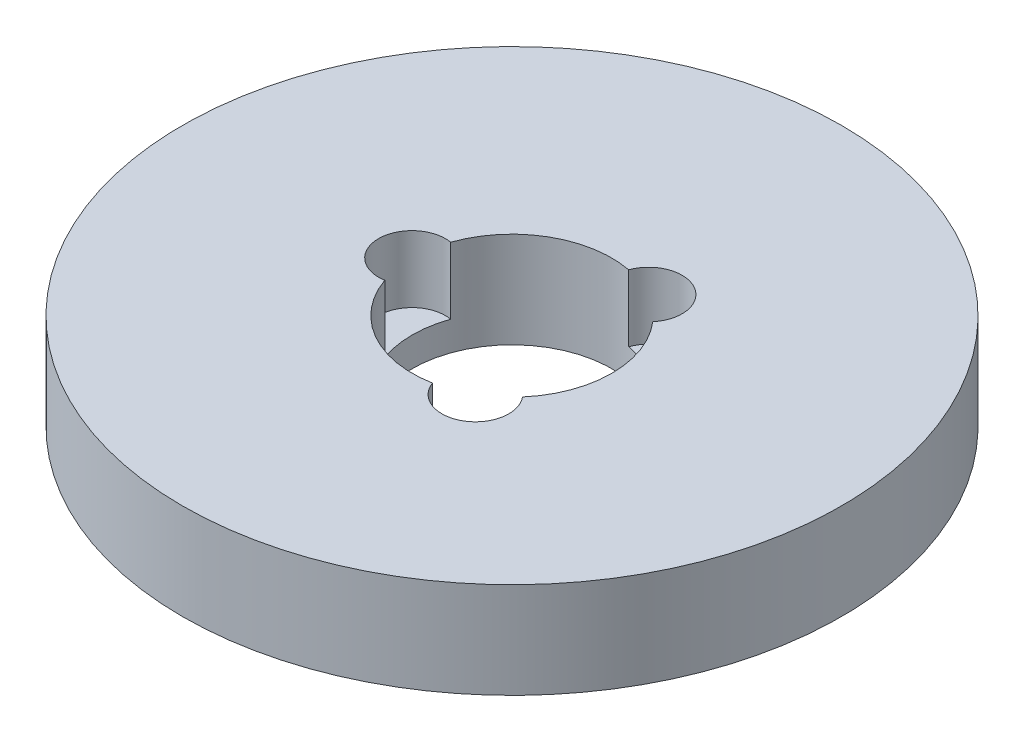
ISO-10303-21;
HEADER;
FILE_DESCRIPTION(('STEP AP214'),'2;1');
FILE_NAME('part.step','',(''),(''),'','','');
FILE_SCHEMA(('AUTOMOTIVE_DESIGN { 1 0 10303 214 1 1 1 1 }'));
ENDSEC;
DATA;
#1=APPLICATION_CONTEXT('core data for automotive mechanical design processes');
#2=APPLICATION_PROTOCOL_DEFINITION('international standard','automotive_design',2000,#1);
#3=PRODUCT_CONTEXT('',#1,'mechanical');
#4=PRODUCT('Part','Part','',(#3));
#5=PRODUCT_RELATED_PRODUCT_CATEGORY('part','',(#4));
#6=PRODUCT_DEFINITION_FORMATION('','',#4);
#7=PRODUCT_DEFINITION_CONTEXT('part definition',#1,'design');
#8=PRODUCT_DEFINITION('design','',#6,#7);
#9=PRODUCT_DEFINITION_SHAPE('','',#8);
#10=(LENGTH_UNIT() NAMED_UNIT(*) SI_UNIT(.MILLI.,.METRE.));
#11=(NAMED_UNIT(*) PLANE_ANGLE_UNIT() SI_UNIT($,.RADIAN.));
#12=(NAMED_UNIT(*) SI_UNIT($,.STERADIAN.) SOLID_ANGLE_UNIT());
#13=UNCERTAINTY_MEASURE_WITH_UNIT(LENGTH_MEASURE(1.E-05),#10,'distance_accuracy_value','');
#14=(GEOMETRIC_REPRESENTATION_CONTEXT(3) GLOBAL_UNCERTAINTY_ASSIGNED_CONTEXT((#13)) GLOBAL_UNIT_ASSIGNED_CONTEXT((#10,
#11,#12)) REPRESENTATION_CONTEXT('',''));
#15=CARTESIAN_POINT('',(0.,0.,0.));
#16=DIRECTION('',(0.,0.,1.));
#17=DIRECTION('',(1.,0.,0.));
#18=AXIS2_PLACEMENT_3D('',#15,#16,#17);
#19=CARTESIAN_POINT('',(0.,24.,0.));
#20=DIRECTION('',(0.,-1.,0.));
#21=DIRECTION('',(0.,0.,-1.));
#22=AXIS2_PLACEMENT_3D('',#19,#20,#21);
#23=CYLINDRICAL_SURFACE('',#22,82.5);
#24=CARTESIAN_POINT('',(0.,24.,0.));
#25=DIRECTION('',(0.,1.,0.));
#26=DIRECTION('',(0.,0.,1.));
#27=AXIS2_PLACEMENT_3D('',#24,#25,#26);
#28=CIRCLE('',#27,82.5);
#29=CARTESIAN_POINT('',(0.,24.,82.5));
#30=VERTEX_POINT('',#29);
#31=EDGE_CURVE('E126',#30,#30,#28,.T.);
#32=ORIENTED_EDGE('',*,*,#31,.F.);
#33=EDGE_LOOP('',(#32));
#34=FACE_BOUND('',#33,.T.);
#35=CARTESIAN_POINT('',(0.,0.,0.));
#36=DIRECTION('',(0.,1.,0.));
#37=DIRECTION('',(0.,0.,1.));
#38=AXIS2_PLACEMENT_3D('',#35,#36,#37);
#39=CIRCLE('',#38,82.5);
#40=CARTESIAN_POINT('',(0.,0.,82.5));
#41=VERTEX_POINT('',#40);
#42=EDGE_CURVE('E124',#41,#41,#39,.T.);
#43=ORIENTED_EDGE('',*,*,#42,.T.);
#44=EDGE_LOOP('',(#43));
#45=FACE_BOUND('',#44,.T.);
#46=ADVANCED_FACE('F39',(#34,#45),#23,.T.);
#47=CARTESIAN_POINT('',(0.,24.,0.));
#48=DIRECTION('',(0.,1.,0.));
#49=DIRECTION('',(0.,0.,1.));
#50=AXIS2_PLACEMENT_3D('',#47,#48,#49);
#51=PLANE('',#50);
#52=CARTESIAN_POINT('',(12.5195269159446,24.,21.684456705142));
#53=DIRECTION('',(0.,1.,0.));
#54=DIRECTION('',(0.866025403784436,0.,-0.500000000000004));
#55=AXIS2_PLACEMENT_3D('',#52,#53,#54);
#56=CIRCLE('',#55,8.37374764726861);
#57=CARTESIAN_POINT('',(4.65594976747831,24.,24.5626165496007));
#58=VERTEX_POINT('',#57);
#59=CARTESIAN_POINT('',(18.9438750316313,24.,16.3134790521806));
#60=VERTEX_POINT('',#59);
#61=EDGE_CURVE('E147',#58,#60,#56,.T.);
#62=ORIENTED_EDGE('',*,*,#61,.F.);
#63=CARTESIAN_POINT('',(0.,24.,0.));
#64=DIRECTION('',(0.,1.,0.));
#65=DIRECTION('',(0.,0.,1.));
#66=AXIS2_PLACEMENT_3D('',#63,#64,#65);
#67=CIRCLE('',#66,25.);
#68=CARTESIAN_POINT('',(-23.5998247991094,24.,8.24913749742));
#69=VERTEX_POINT('',#68);
#70=EDGE_CURVE('E118',#69,#58,#67,.T.);
#71=ORIENTED_EDGE('',*,*,#70,.F.);
#72=CARTESIAN_POINT('',(-25.039053831889,24.,0.));
#73=DIRECTION('',(0.,1.,0.));
#74=DIRECTION('',(0.,0.,1.));
#75=AXIS2_PLACEMENT_3D('',#72,#73,#74);
#76=CIRCLE('',#75,8.37374764726861);
#77=CARTESIAN_POINT('',(-23.5998247991094,24.,-8.24913749742));
#78=VERTEX_POINT('',#77);
#79=EDGE_CURVE('E113',#78,#69,#76,.T.);
#80=ORIENTED_EDGE('',*,*,#79,.F.);
#81=CARTESIAN_POINT('',(4.65594976747797,24.,-24.5626165496008));
#82=VERTEX_POINT('',#81);
#83=EDGE_CURVE('E106',#82,#78,#67,.T.);
#84=ORIENTED_EDGE('',*,*,#83,.F.);
#85=CARTESIAN_POINT('',(12.5195269159443,24.,-21.6844567051421));
#86=DIRECTION('',(0.,1.,0.));
#87=DIRECTION('',(-0.866025403784443,0.,-0.499999999999992));
#88=AXIS2_PLACEMENT_3D('',#85,#86,#87);
#89=CIRCLE('',#88,8.37374764726861);
#90=CARTESIAN_POINT('',(18.9438750316311,24.,-16.3134790521809));
#91=VERTEX_POINT('',#90);
#92=EDGE_CURVE('E90',#91,#82,#89,.T.);
#93=ORIENTED_EDGE('',*,*,#92,.F.);
#94=EDGE_CURVE('E116',#60,#91,#67,.T.);
#95=ORIENTED_EDGE('',*,*,#94,.F.);
#96=EDGE_LOOP('',(#62,#71,#80,#84,#93,#95));
#97=FACE_BOUND('',#96,.T.);
#98=ORIENTED_EDGE('',*,*,#31,.T.);
#99=EDGE_LOOP('',(#98));
#100=FACE_BOUND('',#99,.T.);
#101=ADVANCED_FACE('F115',(#97,#100),#51,.T.);
#102=CARTESIAN_POINT('',(0.,0.,0.));
#103=DIRECTION('',(0.,1.,0.));
#104=DIRECTION('',(0.,0.,1.));
#105=AXIS2_PLACEMENT_3D('',#102,#103,#104);
#106=PLANE('',#105);
#107=CARTESIAN_POINT('',(0.,0.,0.));
#108=DIRECTION('',(0.,1.,0.));
#109=DIRECTION('',(0.,0.,1.));
#110=AXIS2_PLACEMENT_3D('',#107,#108,#109);
#111=CIRCLE('',#110,25.);
#112=CARTESIAN_POINT('',(0.,0.,25.));
#113=VERTEX_POINT('',#112);
#114=EDGE_CURVE('E120',#113,#113,#111,.T.);
#115=ORIENTED_EDGE('',*,*,#114,.T.);
#116=EDGE_LOOP('',(#115));
#117=FACE_BOUND('',#116,.T.);
#118=ORIENTED_EDGE('',*,*,#42,.F.);
#119=EDGE_LOOP('',(#118));
#120=FACE_BOUND('',#119,.T.);
#121=ADVANCED_FACE('F164',(#117,#120),#106,.F.);
#122=CARTESIAN_POINT('',(0.,24.,0.));
#123=DIRECTION('',(0.,-1.,0.));
#124=DIRECTION('',(0.,0.,-1.));
#125=AXIS2_PLACEMENT_3D('',#122,#123,#124);
#126=CYLINDRICAL_SURFACE('',#125,25.);
#127=DIRECTION('',(0.,1.,0.));
#128=VECTOR('',#127,1.);
#129=CARTESIAN_POINT('',(4.65594976747831,15.6559864206288,24.5626165496007));
#130=LINE('',#129,#128);
#131=CARTESIAN_POINT('',(4.65594976747831,7.3119728412577,24.5626165496007));
#132=VERTEX_POINT('',#131);
#133=EDGE_CURVE('E11',#132,#58,#130,.T.);
#134=ORIENTED_EDGE('',*,*,#133,.F.);
#135=CARTESIAN_POINT('',(0.,7.3119728412577,0.));
#136=DIRECTION('',(0.,1.,0.));
#137=DIRECTION('',(0.,0.,1.));
#138=AXIS2_PLACEMENT_3D('',#135,#136,#137);
#139=CIRCLE('',#138,25.);
#140=CARTESIAN_POINT('',(18.9438750316313,7.3119728412577,16.3134790521806));
#141=VERTEX_POINT('',#140);
#142=EDGE_CURVE('E144',#132,#141,#139,.T.);
#143=ORIENTED_EDGE('',*,*,#142,.T.);
#144=DIRECTION('',(0.,1.,0.));
#145=VECTOR('',#144,1.);
#146=CARTESIAN_POINT('',(18.9438750316313,15.6559864206288,16.3134790521806));
#147=LINE('',#146,#145);
#148=EDGE_CURVE('E46',#60,#141,#147,.F.);
#149=ORIENTED_EDGE('',*,*,#148,.F.);
#150=ORIENTED_EDGE('',*,*,#94,.T.);
#151=DIRECTION('',(0.,1.,0.));
#152=VECTOR('',#151,1.);
#153=CARTESIAN_POINT('',(18.9438750316311,15.6559864206288,-16.3134790521809));
#154=LINE('',#153,#152);
#155=CARTESIAN_POINT('',(18.9438750316311,7.3119728412577,-16.3134790521809));
#156=VERTEX_POINT('',#155);
#157=EDGE_CURVE('E92',#156,#91,#154,.T.);
#158=ORIENTED_EDGE('',*,*,#157,.F.);
#159=CARTESIAN_POINT('',(0.,7.3119728412577,0.));
#160=DIRECTION('',(0.,1.,0.));
#161=DIRECTION('',(0.,0.,1.));
#162=AXIS2_PLACEMENT_3D('',#159,#160,#161);
#163=CIRCLE('',#162,25.);
#164=CARTESIAN_POINT('',(4.65594976747797,7.3119728412577,-24.5626165496008));
#165=VERTEX_POINT('',#164);
#166=EDGE_CURVE('E107',#156,#165,#163,.T.);
#167=ORIENTED_EDGE('',*,*,#166,.T.);
#168=DIRECTION('',(0.,1.,0.));
#169=VECTOR('',#168,1.);
#170=CARTESIAN_POINT('',(4.65594976747797,15.6559864206288,-24.5626165496008));
#171=LINE('',#170,#169);
#172=EDGE_CURVE('E95',#82,#165,#171,.F.);
#173=ORIENTED_EDGE('',*,*,#172,.F.);
#174=ORIENTED_EDGE('',*,*,#83,.T.);
#175=DIRECTION('',(0.,1.,0.));
#176=VECTOR('',#175,1.);
#177=CARTESIAN_POINT('',(-23.5998247991094,15.6559864206288,-8.24913749742));
#178=LINE('',#177,#176);
#179=CARTESIAN_POINT('',(-23.5998247991094,7.3119728412577,-8.24913749742));
#180=VERTEX_POINT('',#179);
#181=EDGE_CURVE('E143',#180,#78,#178,.T.);
#182=ORIENTED_EDGE('',*,*,#181,.F.);
#183=CARTESIAN_POINT('',(0.,7.3119728412577,0.));
#184=DIRECTION('',(0.,1.,0.));
#185=DIRECTION('',(0.,0.,1.));
#186=AXIS2_PLACEMENT_3D('',#183,#184,#185);
#187=CIRCLE('',#186,25.);
#188=CARTESIAN_POINT('',(-23.5998247991094,7.3119728412577,8.24913749742));
#189=VERTEX_POINT('',#188);
#190=EDGE_CURVE('E132',#180,#189,#187,.T.);
#191=ORIENTED_EDGE('',*,*,#190,.T.);
#192=DIRECTION('',(0.,1.,0.));
#193=VECTOR('',#192,1.);
#194=CARTESIAN_POINT('',(-23.5998247991094,15.6559864206288,8.24913749742));
#195=LINE('',#194,#193);
#196=EDGE_CURVE('E137',#69,#189,#195,.F.);
#197=ORIENTED_EDGE('',*,*,#196,.F.);
#198=ORIENTED_EDGE('',*,*,#70,.T.);
#199=EDGE_LOOP('',(#134,#143,#149,#150,#158,#167,#173,#174,#182,#191,#197,#198));
#200=FACE_BOUND('',#199,.T.);
#201=ORIENTED_EDGE('',*,*,#114,.F.);
#202=EDGE_LOOP('',(#201));
#203=FACE_BOUND('',#202,.T.);
#204=ADVANCED_FACE('F103',(#200,#203),#126,.F.);
#205=CARTESIAN_POINT('',(-25.039053831889,7.3119728412577,0.));
#206=DIRECTION('',(0.,1.,0.));
#207=DIRECTION('',(0.,0.,1.));
#208=AXIS2_PLACEMENT_3D('',#205,#206,#207);
#209=CYLINDRICAL_SURFACE('',#208,8.37374764726861);
#210=ORIENTED_EDGE('',*,*,#181,.T.);
#211=ORIENTED_EDGE('',*,*,#79,.T.);
#212=ORIENTED_EDGE('',*,*,#196,.T.);
#213=CARTESIAN_POINT('',(-25.039053831889,7.3119728412577,0.));
#214=DIRECTION('',(0.,1.,0.));
#215=DIRECTION('',(0.,0.,1.));
#216=AXIS2_PLACEMENT_3D('',#213,#214,#215);
#217=CIRCLE('',#216,8.37374764726861);
#218=EDGE_CURVE('E121',#180,#189,#217,.T.);
#219=ORIENTED_EDGE('',*,*,#218,.F.);
#220=EDGE_LOOP('',(#210,#211,#212,#219));
#221=FACE_BOUND('',#220,.T.);
#222=ADVANCED_FACE('F174',(#221),#209,.F.);
#223=CARTESIAN_POINT('',(-25.039053831889,7.3119728412577,0.));
#224=DIRECTION('',(0.,1.,0.));
#225=DIRECTION('',(0.,0.,1.));
#226=AXIS2_PLACEMENT_3D('',#223,#224,#225);
#227=PLANE('',#226);
#228=ORIENTED_EDGE('',*,*,#218,.T.);
#229=ORIENTED_EDGE('',*,*,#190,.F.);
#230=EDGE_LOOP('',(#228,#229));
#231=FACE_BOUND('',#230,.T.);
#232=ADVANCED_FACE('F177',(#231),#227,.T.);
#233=CARTESIAN_POINT('',(12.5195269159443,7.3119728412577,-21.6844567051421));
#234=DIRECTION('',(0.,1.,0.));
#235=DIRECTION('',(0.,0.,1.));
#236=AXIS2_PLACEMENT_3D('',#233,#234,#235);
#237=CYLINDRICAL_SURFACE('',#236,8.37374764726861);
#238=ORIENTED_EDGE('',*,*,#157,.T.);
#239=ORIENTED_EDGE('',*,*,#92,.T.);
#240=ORIENTED_EDGE('',*,*,#172,.T.);
#241=CARTESIAN_POINT('',(12.5195269159443,7.3119728412577,-21.6844567051421));
#242=DIRECTION('',(0.,1.,0.));
#243=DIRECTION('',(-0.866025403784443,0.,-0.499999999999992));
#244=AXIS2_PLACEMENT_3D('',#241,#242,#243);
#245=CIRCLE('',#244,8.37374764726861);
#246=EDGE_CURVE('E56',#156,#165,#245,.T.);
#247=ORIENTED_EDGE('',*,*,#246,.F.);
#248=EDGE_LOOP('',(#238,#239,#240,#247));
#249=FACE_BOUND('',#248,.T.);
#250=ADVANCED_FACE('F93',(#249),#237,.F.);
#251=CARTESIAN_POINT('',(12.5195269159443,7.3119728412577,-21.6844567051421));
#252=DIRECTION('',(0.,1.,0.));
#253=DIRECTION('',(-0.866025403784443,0.,-0.499999999999992));
#254=AXIS2_PLACEMENT_3D('',#251,#252,#253);
#255=PLANE('',#254);
#256=ORIENTED_EDGE('',*,*,#246,.T.);
#257=ORIENTED_EDGE('',*,*,#166,.F.);
#258=EDGE_LOOP('',(#256,#257));
#259=FACE_BOUND('',#258,.T.);
#260=ADVANCED_FACE('F160',(#259),#255,.T.);
#261=CARTESIAN_POINT('',(12.5195269159446,7.3119728412577,21.684456705142));
#262=DIRECTION('',(0.,1.,0.));
#263=DIRECTION('',(0.,0.,1.));
#264=AXIS2_PLACEMENT_3D('',#261,#262,#263);
#265=CYLINDRICAL_SURFACE('',#264,8.37374764726861);
#266=ORIENTED_EDGE('',*,*,#133,.T.);
#267=ORIENTED_EDGE('',*,*,#61,.T.);
#268=ORIENTED_EDGE('',*,*,#148,.T.);
#269=CARTESIAN_POINT('',(12.5195269159446,7.3119728412577,21.684456705142));
#270=DIRECTION('',(0.,1.,0.));
#271=DIRECTION('',(0.866025403784436,0.,-0.500000000000004));
#272=AXIS2_PLACEMENT_3D('',#269,#270,#271);
#273=CIRCLE('',#272,8.37374764726861);
#274=EDGE_CURVE('E55',#132,#141,#273,.T.);
#275=ORIENTED_EDGE('',*,*,#274,.F.);
#276=EDGE_LOOP('',(#266,#267,#268,#275));
#277=FACE_BOUND('',#276,.T.);
#278=ADVANCED_FACE('F149',(#277),#265,.F.);
#279=CARTESIAN_POINT('',(12.5195269159446,7.3119728412577,21.684456705142));
#280=DIRECTION('',(0.,1.,0.));
#281=DIRECTION('',(0.866025403784436,0.,-0.500000000000004));
#282=AXIS2_PLACEMENT_3D('',#279,#280,#281);
#283=PLANE('',#282);
#284=ORIENTED_EDGE('',*,*,#274,.T.);
#285=ORIENTED_EDGE('',*,*,#142,.F.);
#286=EDGE_LOOP('',(#284,#285));
#287=FACE_BOUND('',#286,.T.);
#288=ADVANCED_FACE('F151',(#287),#283,.T.);
#289=CLOSED_SHELL('',(#46,#101,#121,#204,#222,#232,#250,#260,#278,#288));
#290=MANIFOLD_SOLID_BREP('B2',#289);
#291=ADVANCED_BREP_SHAPE_REPRESENTATION('',(#18,#290),#14);
#292=SHAPE_DEFINITION_REPRESENTATION(#9,#291);
ENDSEC;
END-ISO-10303-21;
